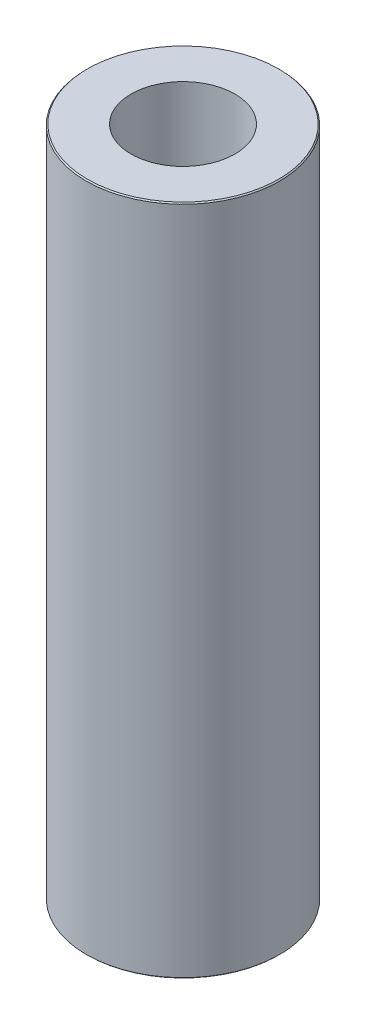
ISO-10303-21;
HEADER;
FILE_DESCRIPTION(('STEP AP214'),'2;1');
FILE_NAME('part.step','',(''),(''),'','','');
FILE_SCHEMA(('AUTOMOTIVE_DESIGN { 1 0 10303 214 1 1 1 1 }'));
ENDSEC;
DATA;
#1=APPLICATION_CONTEXT('core data for automotive mechanical design processes');
#2=APPLICATION_PROTOCOL_DEFINITION('international standard','automotive_design',2000,#1);
#3=PRODUCT_CONTEXT('',#1,'mechanical');
#4=PRODUCT('Part','Part','',(#3));
#5=PRODUCT_RELATED_PRODUCT_CATEGORY('part','',(#4));
#6=PRODUCT_DEFINITION_FORMATION('','',#4);
#7=PRODUCT_DEFINITION_CONTEXT('part definition',#1,'design');
#8=PRODUCT_DEFINITION('design','',#6,#7);
#9=PRODUCT_DEFINITION_SHAPE('','',#8);
#10=(LENGTH_UNIT() NAMED_UNIT(*) SI_UNIT(.MILLI.,.METRE.));
#11=(NAMED_UNIT(*) PLANE_ANGLE_UNIT() SI_UNIT($,.RADIAN.));
#12=(NAMED_UNIT(*) SI_UNIT($,.STERADIAN.) SOLID_ANGLE_UNIT());
#13=UNCERTAINTY_MEASURE_WITH_UNIT(LENGTH_MEASURE(1.E-05),#10,'distance_accuracy_value','');
#14=(GEOMETRIC_REPRESENTATION_CONTEXT(3) GLOBAL_UNCERTAINTY_ASSIGNED_CONTEXT((#13)) GLOBAL_UNIT_ASSIGNED_CONTEXT((#10,
#11,#12)) REPRESENTATION_CONTEXT('',''));
#15=CARTESIAN_POINT('',(0.,0.,0.));
#16=DIRECTION('',(0.,0.,1.));
#17=DIRECTION('',(1.,0.,0.));
#18=AXIS2_PLACEMENT_3D('',#15,#16,#17);
#19=CARTESIAN_POINT('',(0.,295.367295865256,0.));
#20=DIRECTION('',(0.,-1.,0.));
#21=DIRECTION('',(0.,0.,-1.));
#22=AXIS2_PLACEMENT_3D('',#19,#20,#21);
#23=CYLINDRICAL_SURFACE('',#22,42.5);
#24=CARTESIAN_POINT('',(0.,294.869310905591,0.));
#25=DIRECTION('',(0.,1.,0.));
#26=DIRECTION('',(0.,0.,1.));
#27=AXIS2_PLACEMENT_3D('',#24,#25,#26);
#28=CIRCLE('',#27,42.5);
#29=CARTESIAN_POINT('',(0.,294.869310905591,-42.5));
#30=VERTEX_POINT('',#29);
#31=EDGE_CURVE('E50',#30,#30,#28,.F.);
#32=CARTESIAN_POINT('',(0.,0.47899501131915,0.));
#33=DIRECTION('',(0.,1.,0.));
#34=DIRECTION('',(0.,0.,1.));
#35=AXIS2_PLACEMENT_3D('',#32,#33,#34);
#36=CIRCLE('',#35,42.5);
#37=CARTESIAN_POINT('',(0.,0.47899501131915,-42.5));
#38=VERTEX_POINT('',#37);
#39=EDGE_CURVE('E51',#38,#38,#36,.T.);
#40=CARTESIAN_POINT('',(0.,294.869310905591,-42.5));
#41=CARTESIAN_POINT('',(0.,291.802745115026,-42.5));
#42=CARTESIAN_POINT('',(0.,288.73617932446,-42.5));
#43=CARTESIAN_POINT('',(0.,282.60304774333,-42.5));
#44=CARTESIAN_POINT('',(0.,279.536481952764,-42.5));
#45=CARTESIAN_POINT('',(0.,273.403350371634,-42.5));
#46=CARTESIAN_POINT('',(0.,270.336784581068,-42.5));
#47=CARTESIAN_POINT('',(0.,264.203652999938,-42.5));
#48=CARTESIAN_POINT('',(0.,261.137087209372,-42.5));
#49=CARTESIAN_POINT('',(0.,255.003955628242,-42.5));
#50=CARTESIAN_POINT('',(0.,251.937389837676,-42.5));
#51=CARTESIAN_POINT('',(0.,245.804258256546,-42.5));
#52=CARTESIAN_POINT('',(0.,242.73769246598,-42.5));
#53=CARTESIAN_POINT('',(0.,236.60456088485,-42.5));
#54=CARTESIAN_POINT('',(0.,233.537995094284,-42.5));
#55=CARTESIAN_POINT('',(0.,227.404863513154,-42.5));
#56=CARTESIAN_POINT('',(0.,224.338297722588,-42.5));
#57=CARTESIAN_POINT('',(0.,218.205166141458,-42.5));
#58=CARTESIAN_POINT('',(0.,215.138600350892,-42.5));
#59=CARTESIAN_POINT('',(0.,209.005468769762,-42.5));
#60=CARTESIAN_POINT('',(0.,205.938902979196,-42.5));
#61=CARTESIAN_POINT('',(0.,199.805771398066,-42.5));
#62=CARTESIAN_POINT('',(0.,196.7392056075,-42.5));
#63=CARTESIAN_POINT('',(0.,190.60607402637,-42.5));
#64=CARTESIAN_POINT('',(0.,187.539508235804,-42.5));
#65=CARTESIAN_POINT('',(0.,181.406376654674,-42.5));
#66=CARTESIAN_POINT('',(0.,178.339810864108,-42.5));
#67=CARTESIAN_POINT('',(0.,172.206679282978,-42.5));
#68=CARTESIAN_POINT('',(0.,169.140113492412,-42.5));
#69=CARTESIAN_POINT('',(0.,163.006981911282,-42.5));
#70=CARTESIAN_POINT('',(0.,159.940416120716,-42.5));
#71=CARTESIAN_POINT('',(0.,153.807284539586,-42.5));
#72=CARTESIAN_POINT('',(0.,150.74071874902,-42.5));
#73=CARTESIAN_POINT('',(0.,144.60758716789,-42.5));
#74=CARTESIAN_POINT('',(0.,141.541021377324,-42.5));
#75=CARTESIAN_POINT('',(0.,135.407889796194,-42.5));
#76=CARTESIAN_POINT('',(0.,132.341324005628,-42.5));
#77=CARTESIAN_POINT('',(0.,126.208192424498,-42.5));
#78=CARTESIAN_POINT('',(0.,123.141626633932,-42.5));
#79=CARTESIAN_POINT('',(0.,117.008495052802,-42.5));
#80=CARTESIAN_POINT('',(0.,113.941929262236,-42.5));
#81=CARTESIAN_POINT('',(0.,107.808797681106,-42.5));
#82=CARTESIAN_POINT('',(0.,104.74223189054,-42.5));
#83=CARTESIAN_POINT('',(0.,98.6091003094098,-42.5));
#84=CARTESIAN_POINT('',(0.,95.5425345188444,-42.5));
#85=CARTESIAN_POINT('',(0.,89.4094029377138,-42.5));
#86=CARTESIAN_POINT('',(0.,86.3428371471485,-42.5));
#87=CARTESIAN_POINT('',(0.,80.2097055660178,-42.5));
#88=CARTESIAN_POINT('',(0.,77.1431397754525,-42.5));
#89=CARTESIAN_POINT('',(0.,71.0100081943218,-42.5));
#90=CARTESIAN_POINT('',(0.,67.9434424037565,-42.5));
#91=CARTESIAN_POINT('',(0.,61.8103108226258,-42.5));
#92=CARTESIAN_POINT('',(0.,58.7437450320605,-42.5));
#93=CARTESIAN_POINT('',(0.,52.6106134509298,-42.5));
#94=CARTESIAN_POINT('',(0.,49.5440476603645,-42.5));
#95=CARTESIAN_POINT('',(0.,43.4109160792338,-42.5));
#96=CARTESIAN_POINT('',(0.,40.3443502886685,-42.5));
#97=CARTESIAN_POINT('',(0.,34.2112187075379,-42.5));
#98=CARTESIAN_POINT('',(0.,31.1446529169725,-42.5));
#99=CARTESIAN_POINT('',(0.,25.0115213358419,-42.5));
#100=CARTESIAN_POINT('',(0.,21.9449555452765,-42.5));
#101=CARTESIAN_POINT('',(0.,15.8118239641458,-42.5));
#102=CARTESIAN_POINT('',(0.,12.7452581735805,-42.5));
#103=CARTESIAN_POINT('',(0.,6.61212659244983,-42.5));
#104=CARTESIAN_POINT('',(0.,3.54556080188449,-42.5));
#105=CARTESIAN_POINT('',(0.,0.47899501131915,-42.5));
#106=B_SPLINE_CURVE_WITH_KNOTS('',3,(#40,#41,#42,#43,#44,#45,#46,#47,#48,#49,#50,#51,#52,#53,
#54,#55,#56,#57,#58,#59,#60,#61,#62,#63,#64,#65,#66,#67,#68,#69,#70,#71,#72,#73,#74,#75,#76,#77,
#78,#79,#80,#81,#82,#83,#84,#85,#86,#87,#88,#89,#90,#91,#92,#93,#94,#95,#96,#97,#98,#99,#100,
#101,#102,#103,#104,#105),.UNSPECIFIED.,.F.,.F.,(4,2,2,2,2,2,2,2,2,2,2,2,2,2,2,2,2,2,2,2,2,2,2,
2,2,2,2,2,2,2,2,2,4),(0.,9.19969737169601,18.399394743392,27.599092115088,36.798789486784,
45.99848685848,55.198184230176,64.397881601872,73.597578973568,82.797276345264,91.99697371696,
101.196671088656,110.396368460352,119.596065832048,128.795763203744,137.99546057544,
147.195157947136,156.394855318832,165.594552690528,174.794250062224,183.99394743392,
193.193644805616,202.393342177312,211.593039549008,220.792736920704,229.9924342924,
239.192131664096,248.391829035792,257.591526407488,266.791223779184,275.99092115088,
285.190618522576,294.390315894272),.UNSPECIFIED.);
#107=EDGE_CURVE('BSEAM39',#30,#38,#106,.T.);
#108=ORIENTED_EDGE('',*,*,#31,.T.);
#109=ORIENTED_EDGE('',*,*,#39,.T.);
#110=ORIENTED_EDGE('',*,*,#107,.T.);
#111=ORIENTED_EDGE('',*,*,#107,.F.);
#112=EDGE_LOOP('',(#108,#110,#109,#111));
#113=FACE_BOUND('',#112,.T.);
#114=ADVANCED_FACE('F39',(#113),#23,.T.);
#115=CARTESIAN_POINT('',(0.,295.367295865256,0.));
#116=DIRECTION('',(0.,1.,0.));
#117=DIRECTION('',(0.,0.,1.));
#118=AXIS2_PLACEMENT_3D('',#115,#116,#117);
#119=PLANE('',#118);
#120=CARTESIAN_POINT('',(0.,295.367295865256,0.));
#121=DIRECTION('',(0.,1.,0.));
#122=DIRECTION('',(0.,0.,1.));
#123=AXIS2_PLACEMENT_3D('',#120,#121,#122);
#124=CIRCLE('',#123,42.0210049886815);
#125=CARTESIAN_POINT('',(0.,295.367295865256,42.0210049886815));
#126=VERTEX_POINT('',#125);
#127=EDGE_CURVE('E54',#126,#126,#124,.T.);
#128=ORIENTED_EDGE('',*,*,#127,.T.);
#129=EDGE_LOOP('',(#128));
#130=FACE_BOUND('',#129,.T.);
#131=CARTESIAN_POINT('',(0.,295.367295865256,0.));
#132=DIRECTION('',(0.,1.,0.));
#133=DIRECTION('',(0.,0.,1.));
#134=AXIS2_PLACEMENT_3D('',#131,#132,#133);
#135=CIRCLE('',#134,22.8533917947051);
#136=CARTESIAN_POINT('',(0.,295.367295865256,-22.8533917947051));
#137=VERTEX_POINT('',#136);
#138=EDGE_CURVE('E58',#137,#137,#135,.T.);
#139=ORIENTED_EDGE('',*,*,#138,.F.);
#140=EDGE_LOOP('',(#139));
#141=FACE_BOUND('',#140,.T.);
#142=ADVANCED_FACE('F69',(#130,#141),#119,.T.);
#143=CARTESIAN_POINT('',(0.,0.,0.));
#144=DIRECTION('',(0.,1.,0.));
#145=DIRECTION('',(0.,0.,1.));
#146=AXIS2_PLACEMENT_3D('',#143,#144,#145);
#147=PLANE('',#146);
#148=CARTESIAN_POINT('',(0.,0.,0.));
#149=DIRECTION('',(0.,1.,0.));
#150=DIRECTION('',(0.,0.,1.));
#151=AXIS2_PLACEMENT_3D('',#148,#149,#150);
#152=CIRCLE('',#151,42.0020150403349);
#153=CARTESIAN_POINT('',(0.,0.,42.0020150403349));
#154=VERTEX_POINT('',#153);
#155=EDGE_CURVE('E10',#154,#154,#152,.F.);
#156=ORIENTED_EDGE('',*,*,#155,.T.);
#157=EDGE_LOOP('',(#156));
#158=FACE_BOUND('',#157,.T.);
#159=CARTESIAN_POINT('',(0.,0.,0.));
#160=DIRECTION('',(0.,1.,0.));
#161=DIRECTION('',(0.,0.,1.));
#162=AXIS2_PLACEMENT_3D('',#159,#160,#161);
#163=CIRCLE('',#162,22.8533917947051);
#164=CARTESIAN_POINT('',(0.,0.,-22.8533917947051));
#165=VERTEX_POINT('',#164);
#166=EDGE_CURVE('E63',#165,#165,#163,.T.);
#167=ORIENTED_EDGE('',*,*,#166,.T.);
#168=EDGE_LOOP('',(#167));
#169=FACE_BOUND('',#168,.T.);
#170=ADVANCED_FACE('F75',(#158,#169),#147,.F.);
#171=CARTESIAN_POINT('',(0.,295.367295865256,0.));
#172=DIRECTION('',(0.,-1.,0.));
#173=DIRECTION('',(0.,0.,-1.));
#174=AXIS2_PLACEMENT_3D('',#171,#172,#173);
#175=CYLINDRICAL_SURFACE('',#174,22.8533917947051);
#176=CARTESIAN_POINT('',(0.,295.367295865256,-22.8533917947051));
#177=CARTESIAN_POINT('',(0.,292.290553199992,-22.8533917947051));
#178=CARTESIAN_POINT('',(0.,289.213810534729,-22.8533917947051));
#179=CARTESIAN_POINT('',(0.,283.060325204203,-22.8533917947051));
#180=CARTESIAN_POINT('',(0.,279.98358253894,-22.8533917947051));
#181=CARTESIAN_POINT('',(0.,273.830097208414,-22.8533917947051));
#182=CARTESIAN_POINT('',(0.,270.753354543151,-22.8533917947051));
#183=CARTESIAN_POINT('',(0.,264.599869212625,-22.8533917947051));
#184=CARTESIAN_POINT('',(0.,261.523126547362,-22.8533917947051));
#185=CARTESIAN_POINT('',(0.,255.369641216835,-22.8533917947051));
#186=CARTESIAN_POINT('',(0.,252.292898551572,-22.8533917947051));
#187=CARTESIAN_POINT('',(0.,246.139413221046,-22.8533917947051));
#188=CARTESIAN_POINT('',(0.,243.062670555783,-22.8533917947051));
#189=CARTESIAN_POINT('',(0.,236.909185225257,-22.8533917947051));
#190=CARTESIAN_POINT('',(0.,233.832442559994,-22.8533917947051));
#191=CARTESIAN_POINT('',(0.,227.678957229468,-22.8533917947051));
#192=CARTESIAN_POINT('',(0.,224.602214564205,-22.8533917947051));
#193=CARTESIAN_POINT('',(0.,218.448729233679,-22.8533917947051));
#194=CARTESIAN_POINT('',(0.,215.371986568415,-22.8533917947051));
#195=CARTESIAN_POINT('',(0.,209.218501237889,-22.8533917947051));
#196=CARTESIAN_POINT('',(0.,206.141758572626,-22.8533917947051));
#197=CARTESIAN_POINT('',(0.,199.9882732421,-22.8533917947051));
#198=CARTESIAN_POINT('',(0.,196.911530576837,-22.8533917947051));
#199=CARTESIAN_POINT('',(0.,190.758045246311,-22.8533917947051));
#200=CARTESIAN_POINT('',(0.,187.681302581048,-22.8533917947051));
#201=CARTESIAN_POINT('',(0.,181.527817250522,-22.8533917947051));
#202=CARTESIAN_POINT('',(0.,178.451074585259,-22.8533917947051));
#203=CARTESIAN_POINT('',(0.,172.297589254732,-22.8533917947051));
#204=CARTESIAN_POINT('',(0.,169.220846589469,-22.8533917947051));
#205=CARTESIAN_POINT('',(0.,163.067361258943,-22.8533917947051));
#206=CARTESIAN_POINT('',(0.,159.99061859368,-22.8533917947051));
#207=CARTESIAN_POINT('',(0.,153.837133263154,-22.8533917947051));
#208=CARTESIAN_POINT('',(0.,150.760390597891,-22.8533917947051));
#209=CARTESIAN_POINT('',(0.,144.606905267365,-22.8533917947051));
#210=CARTESIAN_POINT('',(0.,141.530162602102,-22.8533917947051));
#211=CARTESIAN_POINT('',(0.,135.376677271575,-22.8533917947051));
#212=CARTESIAN_POINT('',(0.,132.299934606312,-22.8533917947051));
#213=CARTESIAN_POINT('',(0.,126.146449275786,-22.8533917947051));
#214=CARTESIAN_POINT('',(0.,123.069706610523,-22.8533917947051));
#215=CARTESIAN_POINT('',(0.,116.916221279997,-22.8533917947051));
#216=CARTESIAN_POINT('',(0.,113.839478614734,-22.8533917947051));
#217=CARTESIAN_POINT('',(0.,107.685993284208,-22.8533917947051));
#218=CARTESIAN_POINT('',(0.,104.609250618945,-22.8533917947051));
#219=CARTESIAN_POINT('',(0.,98.4557652884184,-22.8533917947051));
#220=CARTESIAN_POINT('',(0.,95.3790226231554,-22.8533917947051));
#221=CARTESIAN_POINT('',(0.,89.2255372926292,-22.8533917947051));
#222=CARTESIAN_POINT('',(0.,86.1487946273661,-22.8533917947051));
#223=CARTESIAN_POINT('',(0.,79.99530929684,-22.8533917947051));
#224=CARTESIAN_POINT('',(0.,76.9185666315769,-22.8533917947051));
#225=CARTESIAN_POINT('',(0.,70.7650813010507,-22.8533917947051));
#226=CARTESIAN_POINT('',(0.,67.6883386357876,-22.8533917947051));
#227=CARTESIAN_POINT('',(0.,61.5348533052615,-22.8533917947051));
#228=CARTESIAN_POINT('',(0.,58.4581106399984,-22.8533917947051));
#229=CARTESIAN_POINT('',(0.,52.3046253094723,-22.8533917947051));
#230=CARTESIAN_POINT('',(0.,49.2278826442092,-22.8533917947051));
#231=CARTESIAN_POINT('',(0.,43.074397313683,-22.8533917947051));
#232=CARTESIAN_POINT('',(0.,39.99765464842,-22.8533917947051));
#233=CARTESIAN_POINT('',(0.,33.8441693178938,-22.8533917947051));
#234=CARTESIAN_POINT('',(0.,30.7674266526308,-22.8533917947051));
#235=CARTESIAN_POINT('',(0.,24.6139413221046,-22.8533917947051));
#236=CARTESIAN_POINT('',(0.,21.5371986568415,-22.8533917947051));
#237=CARTESIAN_POINT('',(0.,15.3837133263153,-22.8533917947051));
#238=CARTESIAN_POINT('',(0.,12.3069706610523,-22.8533917947051));
#239=CARTESIAN_POINT('',(0.,6.15348533052612,-22.8533917947051));
#240=CARTESIAN_POINT('',(0.,3.07674266526303,-22.8533917947051));
#241=CARTESIAN_POINT('',(0.,0.,-22.8533917947051));
#242=B_SPLINE_CURVE_WITH_KNOTS('',3,(#176,#177,#178,#179,#180,#181,#182,#183,#184,#185,#186,
#187,#188,#189,#190,#191,#192,#193,#194,#195,#196,#197,#198,#199,#200,#201,#202,#203,#204,#205,
#206,#207,#208,#209,#210,#211,#212,#213,#214,#215,#216,#217,#218,#219,#220,#221,#222,#223,#224,
#225,#226,#227,#228,#229,#230,#231,#232,#233,#234,#235,#236,#237,#238,#239,#240,#241),
.UNSPECIFIED.,.F.,.F.,(4,2,2,2,2,2,2,2,2,2,2,2,2,2,2,2,2,2,2,2,2,2,2,2,2,2,2,2,2,2,2,2,4),(0.,
9.23022799578926,18.4604559915785,27.6906839873677,36.920911983157,46.1511399789462,
55.3813679747355,64.6115959705247,73.841823966314,83.0720519621032,92.3022799578924,
101.532507953682,110.762735949471,119.99296394526,129.223191941049,138.453419936839,
147.683647932628,156.913875928417,166.144103924206,175.374331919996,184.604559915785,
193.834787911574,203.065015907363,212.295243903153,221.525471898942,230.755699894731,
239.98592789052,249.216155886309,258.446383882099,267.676611877888,276.906839873677,
286.137067869466,295.367295865256),.UNSPECIFIED.);
#243=EDGE_CURVE('BSEAM70',#137,#165,#242,.T.);
#244=ORIENTED_EDGE('',*,*,#138,.T.);
#245=ORIENTED_EDGE('',*,*,#166,.F.);
#246=ORIENTED_EDGE('',*,*,#243,.T.);
#247=ORIENTED_EDGE('',*,*,#243,.F.);
#248=EDGE_LOOP('',(#244,#246,#245,#247));
#249=FACE_BOUND('',#248,.T.);
#250=ADVANCED_FACE('F70',(#249),#175,.F.);
#251=CARTESIAN_POINT('',(0.,295.367295865256,0.));
#252=DIRECTION('',(0.,-1.,0.));
#253=DIRECTION('',(0.,0.,-1.));
#254=AXIS2_PLACEMENT_3D('',#251,#252,#253);
#255=CONICAL_SURFACE('',#254,42.0210049886815,0.76596321293197);
#256=ORIENTED_EDGE('',*,*,#31,.F.);
#257=EDGE_LOOP('',(#256));
#258=FACE_BOUND('',#257,.T.);
#259=ORIENTED_EDGE('',*,*,#127,.F.);
#260=EDGE_LOOP('',(#259));
#261=FACE_BOUND('',#260,.T.);
#262=ADVANCED_FACE('F81',(#258,#261),#255,.T.);
#263=CARTESIAN_POINT('',(0.,0.478995011319094,0.));
#264=DIRECTION('',(0.,1.,0.));
#265=DIRECTION('',(0.,0.,1.));
#266=AXIS2_PLACEMENT_3D('',#263,#264,#265);
#267=CONICAL_SURFACE('',#266,42.5,0.80483311386286);
#268=ORIENTED_EDGE('',*,*,#155,.F.);
#269=EDGE_LOOP('',(#268));
#270=FACE_BOUND('',#269,.T.);
#271=ORIENTED_EDGE('',*,*,#39,.F.);
#272=EDGE_LOOP('',(#271));
#273=FACE_BOUND('',#272,.T.);
#274=ADVANCED_FACE('F45',(#270,#273),#267,.T.);
#275=CLOSED_SHELL('',(#114,#142,#170,#250,#262,#274));
#276=MANIFOLD_SOLID_BREP('B2',#275);
#277=ADVANCED_BREP_SHAPE_REPRESENTATION('',(#18,#276),#14);
#278=SHAPE_DEFINITION_REPRESENTATION(#9,#277);
ENDSEC;
END-ISO-10303-21;
